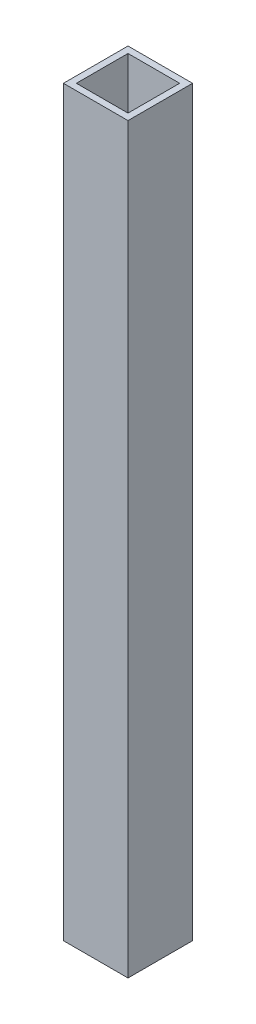
ISO-10303-21;
HEADER;
FILE_DESCRIPTION(('STEP AP214'),'2;1');
FILE_NAME('part.step','',(''),(''),'','','');
FILE_SCHEMA(('AUTOMOTIVE_DESIGN { 1 0 10303 214 1 1 1 1 }'));
ENDSEC;
DATA;
#1=APPLICATION_CONTEXT('core data for automotive mechanical design processes');
#2=APPLICATION_PROTOCOL_DEFINITION('international standard','automotive_design',2000,#1);
#3=PRODUCT_CONTEXT('',#1,'mechanical');
#4=PRODUCT('Part','Part','',(#3));
#5=PRODUCT_RELATED_PRODUCT_CATEGORY('part','',(#4));
#6=PRODUCT_DEFINITION_FORMATION('','',#4);
#7=PRODUCT_DEFINITION_CONTEXT('part definition',#1,'design');
#8=PRODUCT_DEFINITION('design','',#6,#7);
#9=PRODUCT_DEFINITION_SHAPE('','',#8);
#10=(LENGTH_UNIT() NAMED_UNIT(*) SI_UNIT(.MILLI.,.METRE.));
#11=(NAMED_UNIT(*) PLANE_ANGLE_UNIT() SI_UNIT($,.RADIAN.));
#12=(NAMED_UNIT(*) SI_UNIT($,.STERADIAN.) SOLID_ANGLE_UNIT());
#13=UNCERTAINTY_MEASURE_WITH_UNIT(LENGTH_MEASURE(1.E-05),#10,'distance_accuracy_value','');
#14=(GEOMETRIC_REPRESENTATION_CONTEXT(3) GLOBAL_UNCERTAINTY_ASSIGNED_CONTEXT((#13)) GLOBAL_UNIT_ASSIGNED_CONTEXT((#10,
#11,#12)) REPRESENTATION_CONTEXT('',''));
#15=CARTESIAN_POINT('',(0.,0.,0.));
#16=DIRECTION('',(0.,0.,1.));
#17=DIRECTION('',(1.,0.,0.));
#18=AXIS2_PLACEMENT_3D('',#15,#16,#17);
#19=CARTESIAN_POINT('',(-31.7391304347827,49.7826086956523,-20.));
#20=DIRECTION('',(-1.,0.,0.));
#21=DIRECTION('',(0.,-1.,0.));
#22=AXIS2_PLACEMENT_3D('',#19,#20,#21);
#23=PLANE('',#22);
#24=DIRECTION('',(0.,-1.,0.));
#25=VECTOR('',#24,1.);
#26=CARTESIAN_POINT('',(-31.7391304347827,49.7826086956523,0.));
#27=LINE('',#26,#25);
#28=CARTESIAN_POINT('',(-31.7391304347827,49.7826086956523,0.));
#29=VERTEX_POINT('',#28);
#30=CARTESIAN_POINT('',(-31.7391304347826,-180.217391304348,0.));
#31=VERTEX_POINT('',#30);
#32=EDGE_CURVE('E140',#29,#31,#27,.T.);
#33=ORIENTED_EDGE('',*,*,#32,.F.);
#34=DIRECTION('',(0.,0.,1.));
#35=VECTOR('',#34,1.);
#36=CARTESIAN_POINT('',(-31.7391304347827,49.7826086956523,-20.));
#37=LINE('',#36,#35);
#38=CARTESIAN_POINT('',(-31.7391304347827,49.7826086956523,-20.));
#39=VERTEX_POINT('',#38);
#40=EDGE_CURVE('E11',#39,#29,#37,.T.);
#41=ORIENTED_EDGE('',*,*,#40,.F.);
#42=DIRECTION('',(0.,-1.,0.));
#43=VECTOR('',#42,1.);
#44=CARTESIAN_POINT('',(-31.7391304347827,49.7826086956523,-20.));
#45=LINE('',#44,#43);
#46=CARTESIAN_POINT('',(-31.7391304347826,-180.217391304348,-20.));
#47=VERTEX_POINT('',#46);
#48=EDGE_CURVE('E144',#39,#47,#45,.T.);
#49=ORIENTED_EDGE('',*,*,#48,.T.);
#50=DIRECTION('',(0.,0.,1.));
#51=VECTOR('',#50,1.);
#52=CARTESIAN_POINT('',(-31.7391304347826,-180.217391304348,-20.));
#53=LINE('',#52,#51);
#54=EDGE_CURVE('E36',#47,#31,#53,.T.);
#55=ORIENTED_EDGE('',*,*,#54,.T.);
#56=EDGE_LOOP('',(#33,#41,#49,#55));
#57=FACE_BOUND('',#56,.T.);
#58=ADVANCED_FACE('F33',(#57),#23,.T.);
#59=CARTESIAN_POINT('',(-31.7391304347827,49.7826086956523,-20.));
#60=DIRECTION('',(0.,1.,0.));
#61=DIRECTION('',(0.,0.,1.));
#62=AXIS2_PLACEMENT_3D('',#59,#60,#61);
#63=PLANE('',#62);
#64=DIRECTION('',(0.,0.,1.));
#65=VECTOR('',#64,1.);
#66=CARTESIAN_POINT('',(-29.7391304347827,49.7826086956523,-18.));
#67=LINE('',#66,#65);
#68=CARTESIAN_POINT('',(-29.7391304347827,49.7826086956523,-18.));
#69=VERTEX_POINT('',#68);
#70=CARTESIAN_POINT('',(-29.7391304347827,49.7826086956523,-2.));
#71=VERTEX_POINT('',#70);
#72=EDGE_CURVE('E49',#69,#71,#67,.T.);
#73=ORIENTED_EDGE('',*,*,#72,.F.);
#74=DIRECTION('',(-1.,0.,0.));
#75=VECTOR('',#74,1.);
#76=CARTESIAN_POINT('',(-13.7391304347827,49.7826086956523,-18.));
#77=LINE('',#76,#75);
#78=CARTESIAN_POINT('',(-13.7391304347827,49.7826086956523,-18.));
#79=VERTEX_POINT('',#78);
#80=EDGE_CURVE('E125',#79,#69,#77,.T.);
#81=ORIENTED_EDGE('',*,*,#80,.F.);
#82=DIRECTION('',(0.,0.,-1.));
#83=VECTOR('',#82,1.);
#84=CARTESIAN_POINT('',(-13.7391304347827,49.7826086956523,-2.));
#85=LINE('',#84,#83);
#86=CARTESIAN_POINT('',(-13.7391304347827,49.7826086956523,-2.));
#87=VERTEX_POINT('',#86);
#88=EDGE_CURVE('E128',#87,#79,#85,.T.);
#89=ORIENTED_EDGE('',*,*,#88,.F.);
#90=DIRECTION('',(1.,0.,0.));
#91=VECTOR('',#90,1.);
#92=CARTESIAN_POINT('',(-29.7391304347827,49.7826086956523,-2.));
#93=LINE('',#92,#91);
#94=EDGE_CURVE('E134',#71,#87,#93,.T.);
#95=ORIENTED_EDGE('',*,*,#94,.F.);
#96=EDGE_LOOP('',(#73,#81,#89,#95));
#97=FACE_BOUND('',#96,.T.);
#98=DIRECTION('',(-1.,0.,0.));
#99=VECTOR('',#98,1.);
#100=CARTESIAN_POINT('',(-31.7391304347827,49.7826086956523,0.));
#101=LINE('',#100,#99);
#102=CARTESIAN_POINT('',(-11.7391304347827,49.7826086956523,0.));
#103=VERTEX_POINT('',#102);
#104=EDGE_CURVE('E147',#103,#29,#101,.T.);
#105=ORIENTED_EDGE('',*,*,#104,.F.);
#106=DIRECTION('',(0.,0.,1.));
#107=VECTOR('',#106,1.);
#108=CARTESIAN_POINT('',(-11.7391304347827,49.7826086956523,-20.));
#109=LINE('',#108,#107);
#110=CARTESIAN_POINT('',(-11.7391304347827,49.7826086956523,-20.));
#111=VERTEX_POINT('',#110);
#112=EDGE_CURVE('E41',#111,#103,#109,.T.);
#113=ORIENTED_EDGE('',*,*,#112,.F.);
#114=DIRECTION('',(-1.,0.,0.));
#115=VECTOR('',#114,1.);
#116=CARTESIAN_POINT('',(-31.7391304347827,49.7826086956523,-20.));
#117=LINE('',#116,#115);
#118=EDGE_CURVE('E152',#111,#39,#117,.T.);
#119=ORIENTED_EDGE('',*,*,#118,.T.);
#120=ORIENTED_EDGE('',*,*,#40,.T.);
#121=EDGE_LOOP('',(#105,#113,#119,#120));
#122=FACE_BOUND('',#121,.T.);
#123=ADVANCED_FACE('F169',(#97,#122),#63,.T.);
#124=CARTESIAN_POINT('',(-11.7391304347827,49.7826086956523,-20.));
#125=DIRECTION('',(1.,0.,0.));
#126=DIRECTION('',(0.,1.,0.));
#127=AXIS2_PLACEMENT_3D('',#124,#125,#126);
#128=PLANE('',#127);
#129=DIRECTION('',(0.,1.,0.));
#130=VECTOR('',#129,1.);
#131=CARTESIAN_POINT('',(-11.7391304347827,49.7826086956523,0.));
#132=LINE('',#131,#130);
#133=CARTESIAN_POINT('',(-11.7391304347826,-180.217391304348,0.));
#134=VERTEX_POINT('',#133);
#135=EDGE_CURVE('E159',#134,#103,#132,.T.);
#136=ORIENTED_EDGE('',*,*,#135,.F.);
#137=DIRECTION('',(0.,0.,1.));
#138=VECTOR('',#137,1.);
#139=CARTESIAN_POINT('',(-11.7391304347826,-180.217391304348,-20.));
#140=LINE('',#139,#138);
#141=CARTESIAN_POINT('',(-11.7391304347826,-180.217391304348,-20.));
#142=VERTEX_POINT('',#141);
#143=EDGE_CURVE('E164',#142,#134,#140,.T.);
#144=ORIENTED_EDGE('',*,*,#143,.F.);
#145=DIRECTION('',(0.,1.,0.));
#146=VECTOR('',#145,1.);
#147=CARTESIAN_POINT('',(-11.7391304347827,49.7826086956523,-20.));
#148=LINE('',#147,#146);
#149=EDGE_CURVE('E149',#142,#111,#148,.T.);
#150=ORIENTED_EDGE('',*,*,#149,.T.);
#151=ORIENTED_EDGE('',*,*,#112,.T.);
#152=EDGE_LOOP('',(#136,#144,#150,#151));
#153=FACE_BOUND('',#152,.T.);
#154=ADVANCED_FACE('F173',(#153),#128,.T.);
#155=CARTESIAN_POINT('',(-31.7391304347826,-180.217391304348,-20.));
#156=DIRECTION('',(0.,-1.,0.));
#157=DIRECTION('',(0.,0.,-1.));
#158=AXIS2_PLACEMENT_3D('',#155,#156,#157);
#159=PLANE('',#158);
#160=DIRECTION('',(1.,0.,0.));
#161=VECTOR('',#160,1.);
#162=CARTESIAN_POINT('',(-31.7391304347826,-180.217391304348,0.));
#163=LINE('',#162,#161);
#164=EDGE_CURVE('E156',#31,#134,#163,.T.);
#165=ORIENTED_EDGE('',*,*,#164,.F.);
#166=ORIENTED_EDGE('',*,*,#54,.F.);
#167=DIRECTION('',(1.,0.,0.));
#168=VECTOR('',#167,1.);
#169=CARTESIAN_POINT('',(-31.7391304347826,-180.217391304348,-20.));
#170=LINE('',#169,#168);
#171=EDGE_CURVE('E146',#47,#142,#170,.T.);
#172=ORIENTED_EDGE('',*,*,#171,.T.);
#173=ORIENTED_EDGE('',*,*,#143,.T.);
#174=EDGE_LOOP('',(#165,#166,#172,#173));
#175=FACE_BOUND('',#174,.T.);
#176=ADVANCED_FACE('F166',(#175),#159,.T.);
#177=CARTESIAN_POINT('',(0.,0.,-20.));
#178=DIRECTION('',(0.,0.,1.));
#179=DIRECTION('',(1.,0.,0.));
#180=AXIS2_PLACEMENT_3D('',#177,#178,#179);
#181=PLANE('',#180);
#182=ORIENTED_EDGE('',*,*,#48,.F.);
#183=ORIENTED_EDGE('',*,*,#118,.F.);
#184=ORIENTED_EDGE('',*,*,#149,.F.);
#185=ORIENTED_EDGE('',*,*,#171,.F.);
#186=EDGE_LOOP('',(#182,#183,#184,#185));
#187=FACE_BOUND('',#186,.T.);
#188=ADVANCED_FACE('F175',(#187),#181,.F.);
#189=CARTESIAN_POINT('',(0.,0.,0.));
#190=DIRECTION('',(0.,0.,1.));
#191=DIRECTION('',(1.,0.,0.));
#192=AXIS2_PLACEMENT_3D('',#189,#190,#191);
#193=PLANE('',#192);
#194=ORIENTED_EDGE('',*,*,#32,.T.);
#195=ORIENTED_EDGE('',*,*,#164,.T.);
#196=ORIENTED_EDGE('',*,*,#135,.T.);
#197=ORIENTED_EDGE('',*,*,#104,.T.);
#198=EDGE_LOOP('',(#194,#195,#196,#197));
#199=FACE_BOUND('',#198,.T.);
#200=ADVANCED_FACE('F168',(#199),#193,.T.);
#201=CARTESIAN_POINT('',(-29.7391304347827,-150.217391304348,-18.));
#202=DIRECTION('',(-1.,0.,0.));
#203=DIRECTION('',(0.,0.,1.));
#204=AXIS2_PLACEMENT_3D('',#201,#202,#203);
#205=PLANE('',#204);
#206=ORIENTED_EDGE('',*,*,#72,.T.);
#207=DIRECTION('',(0.,1.,0.));
#208=VECTOR('',#207,1.);
#209=CARTESIAN_POINT('',(-29.7391304347827,-150.217391304348,-2.));
#210=LINE('',#209,#208);
#211=CARTESIAN_POINT('',(-29.7391304347827,-150.217391304348,-2.));
#212=VERTEX_POINT('',#211);
#213=EDGE_CURVE('E103',#212,#71,#210,.T.);
#214=ORIENTED_EDGE('',*,*,#213,.F.);
#215=DIRECTION('',(0.,0.,1.));
#216=VECTOR('',#215,1.);
#217=CARTESIAN_POINT('',(-29.7391304347827,-150.217391304348,-18.));
#218=LINE('',#217,#216);
#219=CARTESIAN_POINT('',(-29.7391304347827,-150.217391304348,-18.));
#220=VERTEX_POINT('',#219);
#221=EDGE_CURVE('E107',#220,#212,#218,.T.);
#222=ORIENTED_EDGE('',*,*,#221,.F.);
#223=DIRECTION('',(0.,1.,0.));
#224=VECTOR('',#223,1.);
#225=CARTESIAN_POINT('',(-29.7391304347827,-150.217391304348,-18.));
#226=LINE('',#225,#224);
#227=EDGE_CURVE('E138',#220,#69,#226,.T.);
#228=ORIENTED_EDGE('',*,*,#227,.T.);
#229=EDGE_LOOP('',(#206,#214,#222,#228));
#230=FACE_BOUND('',#229,.T.);
#231=ADVANCED_FACE('F105',(#230),#205,.F.);
#232=CARTESIAN_POINT('',(-13.7391304347827,-150.217391304348,-18.));
#233=DIRECTION('',(0.,0.,-1.));
#234=DIRECTION('',(-1.,0.,0.));
#235=AXIS2_PLACEMENT_3D('',#232,#233,#234);
#236=PLANE('',#235);
#237=ORIENTED_EDGE('',*,*,#80,.T.);
#238=ORIENTED_EDGE('',*,*,#227,.F.);
#239=DIRECTION('',(-1.,0.,0.));
#240=VECTOR('',#239,1.);
#241=CARTESIAN_POINT('',(-13.7391304347827,-150.217391304348,-18.));
#242=LINE('',#241,#240);
#243=CARTESIAN_POINT('',(-13.7391304347827,-150.217391304348,-18.));
#244=VERTEX_POINT('',#243);
#245=EDGE_CURVE('E113',#244,#220,#242,.T.);
#246=ORIENTED_EDGE('',*,*,#245,.F.);
#247=DIRECTION('',(0.,1.,0.));
#248=VECTOR('',#247,1.);
#249=CARTESIAN_POINT('',(-13.7391304347827,-150.217391304348,-18.));
#250=LINE('',#249,#248);
#251=EDGE_CURVE('E141',#244,#79,#250,.T.);
#252=ORIENTED_EDGE('',*,*,#251,.T.);
#253=EDGE_LOOP('',(#237,#238,#246,#252));
#254=FACE_BOUND('',#253,.T.);
#255=ADVANCED_FACE('F199',(#254),#236,.F.);
#256=CARTESIAN_POINT('',(-13.7391304347827,-150.217391304348,-2.));
#257=DIRECTION('',(1.,0.,0.));
#258=DIRECTION('',(0.,0.,-1.));
#259=AXIS2_PLACEMENT_3D('',#256,#257,#258);
#260=PLANE('',#259);
#261=ORIENTED_EDGE('',*,*,#88,.T.);
#262=ORIENTED_EDGE('',*,*,#251,.F.);
#263=DIRECTION('',(0.,0.,-1.));
#264=VECTOR('',#263,1.);
#265=CARTESIAN_POINT('',(-13.7391304347827,-150.217391304348,-2.));
#266=LINE('',#265,#264);
#267=CARTESIAN_POINT('',(-13.7391304347827,-150.217391304348,-2.));
#268=VERTEX_POINT('',#267);
#269=EDGE_CURVE('E121',#268,#244,#266,.T.);
#270=ORIENTED_EDGE('',*,*,#269,.F.);
#271=DIRECTION('',(0.,1.,0.));
#272=VECTOR('',#271,1.);
#273=CARTESIAN_POINT('',(-13.7391304347827,-150.217391304348,-2.));
#274=LINE('',#273,#272);
#275=EDGE_CURVE('E112',#268,#87,#274,.T.);
#276=ORIENTED_EDGE('',*,*,#275,.T.);
#277=EDGE_LOOP('',(#261,#262,#270,#276));
#278=FACE_BOUND('',#277,.T.);
#279=ADVANCED_FACE('F197',(#278),#260,.F.);
#280=CARTESIAN_POINT('',(-29.7391304347827,-150.217391304348,-2.));
#281=DIRECTION('',(0.,0.,1.));
#282=DIRECTION('',(1.,0.,0.));
#283=AXIS2_PLACEMENT_3D('',#280,#281,#282);
#284=PLANE('',#283);
#285=ORIENTED_EDGE('',*,*,#94,.T.);
#286=ORIENTED_EDGE('',*,*,#275,.F.);
#287=DIRECTION('',(1.,0.,0.));
#288=VECTOR('',#287,1.);
#289=CARTESIAN_POINT('',(-29.7391304347827,-150.217391304348,-2.));
#290=LINE('',#289,#288);
#291=EDGE_CURVE('E116',#212,#268,#290,.T.);
#292=ORIENTED_EDGE('',*,*,#291,.F.);
#293=ORIENTED_EDGE('',*,*,#213,.T.);
#294=EDGE_LOOP('',(#285,#286,#292,#293));
#295=FACE_BOUND('',#294,.T.);
#296=ADVANCED_FACE('F117',(#295),#284,.F.);
#297=CARTESIAN_POINT('',(0.,-150.217391304348,0.));
#298=DIRECTION('',(0.,1.,0.));
#299=DIRECTION('',(0.,0.,1.));
#300=AXIS2_PLACEMENT_3D('',#297,#298,#299);
#301=PLANE('',#300);
#302=ORIENTED_EDGE('',*,*,#221,.T.);
#303=ORIENTED_EDGE('',*,*,#291,.T.);
#304=ORIENTED_EDGE('',*,*,#269,.T.);
#305=ORIENTED_EDGE('',*,*,#245,.T.);
#306=EDGE_LOOP('',(#302,#303,#304,#305));
#307=FACE_BOUND('',#306,.T.);
#308=ADVANCED_FACE('F123',(#307),#301,.T.);
#309=CLOSED_SHELL('',(#58,#123,#154,#176,#188,#200,#231,#255,#279,#296,#308));
#310=MANIFOLD_SOLID_BREP('B2',#309);
#311=ADVANCED_BREP_SHAPE_REPRESENTATION('',(#18,#310),#14);
#312=SHAPE_DEFINITION_REPRESENTATION(#9,#311);
ENDSEC;
END-ISO-10303-21;
